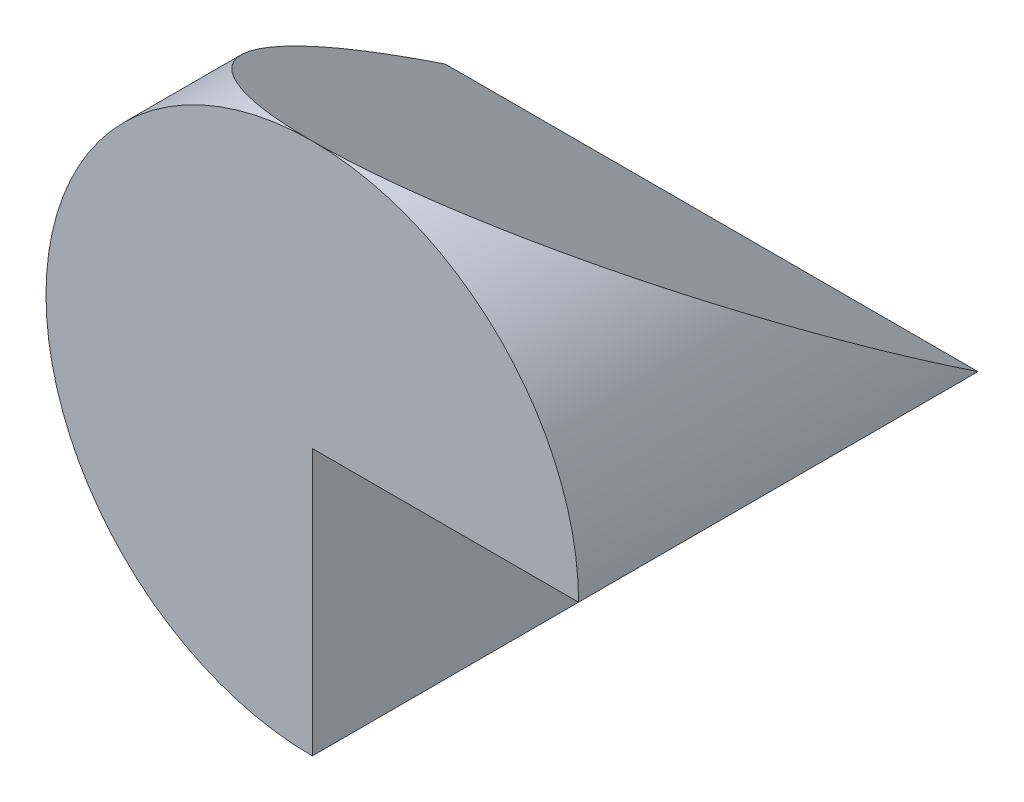
ISO-10303-21;
HEADER;
FILE_DESCRIPTION(('STEP AP214'),'2;1');
FILE_NAME('part.step','',(''),(''),'','','');
FILE_SCHEMA(('AUTOMOTIVE_DESIGN { 1 0 10303 214 1 1 1 1 }'));
ENDSEC;
DATA;
#1=APPLICATION_CONTEXT('core data for automotive mechanical design processes');
#2=APPLICATION_PROTOCOL_DEFINITION('international standard','automotive_design',2000,#1);
#3=PRODUCT_CONTEXT('',#1,'mechanical');
#4=PRODUCT('Part','Part','',(#3));
#5=PRODUCT_RELATED_PRODUCT_CATEGORY('part','',(#4));
#6=PRODUCT_DEFINITION_FORMATION('','',#4);
#7=PRODUCT_DEFINITION_CONTEXT('part definition',#1,'design');
#8=PRODUCT_DEFINITION('design','',#6,#7);
#9=PRODUCT_DEFINITION_SHAPE('','',#8);
#10=(LENGTH_UNIT() NAMED_UNIT(*) SI_UNIT(.MILLI.,.METRE.));
#11=(NAMED_UNIT(*) PLANE_ANGLE_UNIT() SI_UNIT($,.RADIAN.));
#12=(NAMED_UNIT(*) SI_UNIT($,.STERADIAN.) SOLID_ANGLE_UNIT());
#13=UNCERTAINTY_MEASURE_WITH_UNIT(LENGTH_MEASURE(1.E-05),#10,'distance_accuracy_value','');
#14=(GEOMETRIC_REPRESENTATION_CONTEXT(3) GLOBAL_UNCERTAINTY_ASSIGNED_CONTEXT((#13)) GLOBAL_UNIT_ASSIGNED_CONTEXT((#10,
#11,#12)) REPRESENTATION_CONTEXT('',''));
#15=CARTESIAN_POINT('',(0.,0.,0.));
#16=DIRECTION('',(0.,0.,1.));
#17=DIRECTION('',(1.,0.,0.));
#18=AXIS2_PLACEMENT_3D('',#15,#16,#17);
#19=CARTESIAN_POINT('',(0.,0.,15.));
#20=DIRECTION('',(0.,0.,-1.));
#21=DIRECTION('',(-1.,0.,0.));
#22=AXIS2_PLACEMENT_3D('',#19,#20,#21);
#23=CYLINDRICAL_SURFACE('',#22,10.);
#24=CARTESIAN_POINT('',(0.,0.,15.));
#25=DIRECTION('',(0.,0.,1.));
#26=DIRECTION('',(1.,0.,0.));
#27=AXIS2_PLACEMENT_3D('',#24,#25,#26);
#28=CIRCLE('',#27,10.);
#29=CARTESIAN_POINT('',(0.,10.,15.));
#30=VERTEX_POINT('',#29);
#31=CARTESIAN_POINT('',(0.,-10.,15.));
#32=VERTEX_POINT('',#31);
#33=EDGE_CURVE('E42',#30,#32,#28,.T.);
#34=ORIENTED_EDGE('',*,*,#33,.F.);
#35=CARTESIAN_POINT('',(0.,0.,0.));
#36=DIRECTION('',(0.,-0.832050294337844,0.554700196225229));
#37=DIRECTION('',(0.,-0.554700196225229,-0.832050294337844));
#38=AXIS2_PLACEMENT_3D('',#35,#36,#37);
#39=ELLIPSE('',#38,18.0277563773199,10.);
#40=CARTESIAN_POINT('',(-10.,0.,0.));
#41=VERTEX_POINT('',#40);
#42=EDGE_CURVE('E98',#30,#41,#39,.T.);
#43=ORIENTED_EDGE('',*,*,#42,.T.);
#44=CARTESIAN_POINT('',(0.,0.,0.));
#45=DIRECTION('',(0.,0.,1.));
#46=DIRECTION('',(1.,0.,0.));
#47=AXIS2_PLACEMENT_3D('',#44,#45,#46);
#48=CIRCLE('',#47,10.);
#49=CARTESIAN_POINT('',(0.,-10.,0.));
#50=VERTEX_POINT('',#49);
#51=EDGE_CURVE('E37',#41,#50,#48,.T.);
#52=ORIENTED_EDGE('',*,*,#51,.T.);
#53=DIRECTION('',(0.,0.,1.));
#54=VECTOR('',#53,1.);
#55=CARTESIAN_POINT('',(0.,-10.,0.));
#56=LINE('',#55,#54);
#57=EDGE_CURVE('E80',#50,#32,#56,.T.);
#58=ORIENTED_EDGE('',*,*,#57,.T.);
#59=EDGE_LOOP('',(#34,#43,#52,#58));
#60=FACE_BOUND('',#59,.T.);
#61=ADVANCED_FACE('F33',(#60),#23,.T.);
#62=CARTESIAN_POINT('',(0.,0.,0.));
#63=DIRECTION('',(0.,0.,1.));
#64=DIRECTION('',(1.,0.,0.));
#65=AXIS2_PLACEMENT_3D('',#62,#63,#64);
#66=PLANE('',#65);
#67=ORIENTED_EDGE('',*,*,#51,.F.);
#68=DIRECTION('',(1.,0.,0.));
#69=VECTOR('',#68,1.);
#70=CARTESIAN_POINT('',(-10.,0.,0.));
#71=LINE('',#70,#69);
#72=CARTESIAN_POINT('',(0.,0.,0.));
#73=VERTEX_POINT('',#72);
#74=EDGE_CURVE('E100',#41,#73,#71,.T.);
#75=ORIENTED_EDGE('',*,*,#74,.T.);
#76=DIRECTION('',(0.,-1.,0.));
#77=VECTOR('',#76,1.);
#78=CARTESIAN_POINT('',(0.,0.,0.));
#79=LINE('',#78,#77);
#80=EDGE_CURVE('E91',#73,#50,#79,.T.);
#81=ORIENTED_EDGE('',*,*,#80,.T.);
#82=EDGE_LOOP('',(#67,#75,#81));
#83=FACE_BOUND('',#82,.T.);
#84=ADVANCED_FACE('F105',(#83),#66,.F.);
#85=DIRECTION('',(0.,0.,1.));
#86=VECTOR('',#85,1.);
#87=CARTESIAN_POINT('',(10.,0.,0.));
#88=LINE('',#87,#86);
#89=CARTESIAN_POINT('',(10.,0.,0.));
#90=VERTEX_POINT('',#89);
#91=CARTESIAN_POINT('',(10.,0.,15.));
#92=VERTEX_POINT('',#91);
#93=EDGE_CURVE('E88',#90,#92,#88,.T.);
#94=ORIENTED_EDGE('',*,*,#93,.F.);
#95=CARTESIAN_POINT('',(0.,0.,0.));
#96=DIRECTION('',(0.,-0.832050294337844,0.554700196225229));
#97=DIRECTION('',(0.,-0.554700196225229,-0.832050294337844));
#98=AXIS2_PLACEMENT_3D('',#95,#96,#97);
#99=ELLIPSE('',#98,18.0277563773199,10.);
#100=EDGE_CURVE('E57',#90,#30,#99,.T.);
#101=ORIENTED_EDGE('',*,*,#100,.T.);
#102=EDGE_CURVE('E11',#92,#30,#28,.T.);
#103=ORIENTED_EDGE('',*,*,#102,.F.);
#104=EDGE_LOOP('',(#94,#101,#103));
#105=FACE_BOUND('',#104,.T.);
#106=ADVANCED_FACE('F35',(#105),#23,.T.);
#107=CARTESIAN_POINT('',(0.,0.,15.));
#108=DIRECTION('',(0.,0.,1.));
#109=DIRECTION('',(1.,0.,0.));
#110=AXIS2_PLACEMENT_3D('',#107,#108,#109);
#111=PLANE('',#110);
#112=DIRECTION('',(0.,-1.,0.));
#113=VECTOR('',#112,1.);
#114=CARTESIAN_POINT('',(0.,0.,15.));
#115=LINE('',#114,#113);
#116=CARTESIAN_POINT('',(0.,0.,15.));
#117=VERTEX_POINT('',#116);
#118=EDGE_CURVE('E75',#117,#32,#115,.T.);
#119=ORIENTED_EDGE('',*,*,#118,.F.);
#120=DIRECTION('',(1.,0.,0.));
#121=VECTOR('',#120,1.);
#122=CARTESIAN_POINT('',(0.,0.,15.));
#123=LINE('',#122,#121);
#124=EDGE_CURVE('E86',#117,#92,#123,.T.);
#125=ORIENTED_EDGE('',*,*,#124,.T.);
#126=ORIENTED_EDGE('',*,*,#102,.T.);
#127=ORIENTED_EDGE('',*,*,#33,.T.);
#128=EDGE_LOOP('',(#119,#125,#126,#127));
#129=FACE_BOUND('',#128,.T.);
#130=ADVANCED_FACE('F73',(#129),#111,.T.);
#131=CARTESIAN_POINT('',(0.,0.,0.));
#132=DIRECTION('',(0.,-1.,0.));
#133=DIRECTION('',(0.,0.,-1.));
#134=AXIS2_PLACEMENT_3D('',#131,#132,#133);
#135=PLANE('',#134);
#136=ORIENTED_EDGE('',*,*,#124,.F.);
#137=DIRECTION('',(0.,0.,1.));
#138=VECTOR('',#137,1.);
#139=CARTESIAN_POINT('',(0.,0.,0.));
#140=LINE('',#139,#138);
#141=EDGE_CURVE('E83',#73,#117,#140,.T.);
#142=ORIENTED_EDGE('',*,*,#141,.F.);
#143=DIRECTION('',(1.,0.,0.));
#144=VECTOR('',#143,1.);
#145=CARTESIAN_POINT('',(0.,0.,0.));
#146=LINE('',#145,#144);
#147=EDGE_CURVE('E85',#73,#90,#146,.T.);
#148=ORIENTED_EDGE('',*,*,#147,.T.);
#149=ORIENTED_EDGE('',*,*,#93,.T.);
#150=EDGE_LOOP('',(#136,#142,#148,#149));
#151=FACE_BOUND('',#150,.T.);
#152=ADVANCED_FACE('F110',(#151),#135,.T.);
#153=CARTESIAN_POINT('',(0.,0.,0.));
#154=DIRECTION('',(-1.,0.,0.));
#155=DIRECTION('',(0.,0.,1.));
#156=AXIS2_PLACEMENT_3D('',#153,#154,#155);
#157=PLANE('',#156);
#158=ORIENTED_EDGE('',*,*,#118,.T.);
#159=ORIENTED_EDGE('',*,*,#57,.F.);
#160=ORIENTED_EDGE('',*,*,#80,.F.);
#161=ORIENTED_EDGE('',*,*,#141,.T.);
#162=EDGE_LOOP('',(#158,#159,#160,#161));
#163=FACE_BOUND('',#162,.T.);
#164=ADVANCED_FACE('F78',(#163),#157,.F.);
#165=CARTESIAN_POINT('',(0.,10.,15.));
#166=DIRECTION('',(0.,-0.832050294337844,0.554700196225229));
#167=DIRECTION('',(0.,-0.554700196225229,-0.832050294337844));
#168=AXIS2_PLACEMENT_3D('',#165,#166,#167);
#169=PLANE('',#168);
#170=ORIENTED_EDGE('',*,*,#147,.F.);
#171=ORIENTED_EDGE('',*,*,#74,.F.);
#172=ORIENTED_EDGE('',*,*,#42,.F.);
#173=ORIENTED_EDGE('',*,*,#100,.F.);
#174=EDGE_LOOP('',(#170,#171,#172,#173));
#175=FACE_BOUND('',#174,.T.);
#176=ADVANCED_FACE('F107',(#175),#169,.F.);
#177=CLOSED_SHELL('',(#61,#84,#106,#130,#152,#164,#176));
#178=MANIFOLD_SOLID_BREP('B2',#177);
#179=ADVANCED_BREP_SHAPE_REPRESENTATION('',(#18,#178),#14);
#180=SHAPE_DEFINITION_REPRESENTATION(#9,#179);
ENDSEC;
END-ISO-10303-21;
